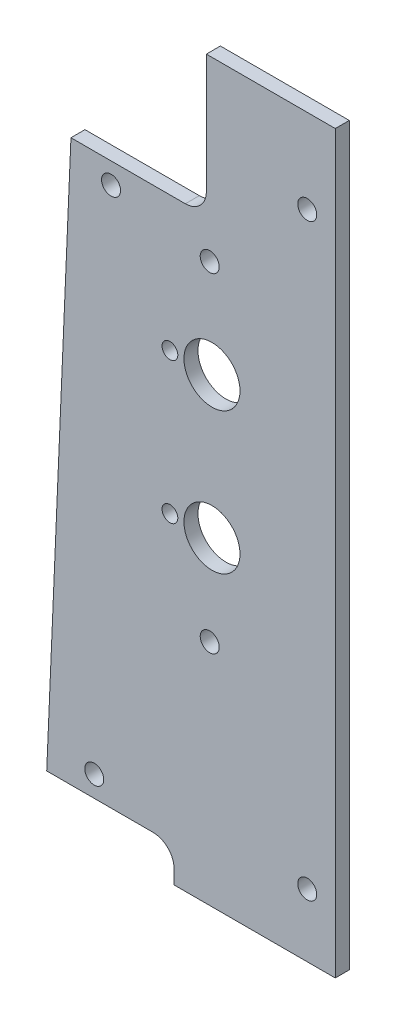
ISO-10303-21;
HEADER;
FILE_DESCRIPTION(('STEP AP214'),'2;1');
FILE_NAME('part.step','',(''),(''),'','','');
FILE_SCHEMA(('AUTOMOTIVE_DESIGN { 1 0 10303 214 1 1 1 1 }'));
ENDSEC;
DATA;
#1=APPLICATION_CONTEXT('core data for automotive mechanical design processes');
#2=APPLICATION_PROTOCOL_DEFINITION('international standard','automotive_design',2000,#1);
#3=PRODUCT_CONTEXT('',#1,'mechanical');
#4=PRODUCT('Part','Part','',(#3));
#5=PRODUCT_RELATED_PRODUCT_CATEGORY('part','',(#4));
#6=PRODUCT_DEFINITION_FORMATION('','',#4);
#7=PRODUCT_DEFINITION_CONTEXT('part definition',#1,'design');
#8=PRODUCT_DEFINITION('design','',#6,#7);
#9=PRODUCT_DEFINITION_SHAPE('','',#8);
#10=(LENGTH_UNIT() NAMED_UNIT(*) SI_UNIT(.MILLI.,.METRE.));
#11=(NAMED_UNIT(*) PLANE_ANGLE_UNIT() SI_UNIT($,.RADIAN.));
#12=(NAMED_UNIT(*) SI_UNIT($,.STERADIAN.) SOLID_ANGLE_UNIT());
#13=UNCERTAINTY_MEASURE_WITH_UNIT(LENGTH_MEASURE(1.E-05),#10,'distance_accuracy_value','');
#14=(GEOMETRIC_REPRESENTATION_CONTEXT(3) GLOBAL_UNCERTAINTY_ASSIGNED_CONTEXT((#13)) GLOBAL_UNIT_ASSIGNED_CONTEXT((#10,
#11,#12)) REPRESENTATION_CONTEXT('',''));
#15=CARTESIAN_POINT('',(0.,0.,0.));
#16=DIRECTION('',(0.,0.,1.));
#17=DIRECTION('',(1.,0.,0.));
#18=AXIS2_PLACEMENT_3D('',#15,#16,#17);
#19=CARTESIAN_POINT('',(-36.5125,3.175,-3.175));
#20=DIRECTION('',(-1.,0.,0.));
#21=DIRECTION('',(0.,-1.,0.));
#22=AXIS2_PLACEMENT_3D('',#19,#20,#21);
#23=PLANE('',#22);
#24=DIRECTION('',(0.,-1.,0.));
#25=VECTOR('',#24,1.);
#26=CARTESIAN_POINT('',(-36.5125,3.175,0.));
#27=LINE('',#26,#25);
#28=CARTESIAN_POINT('',(-36.5125,3.175,0.));
#29=VERTEX_POINT('',#28);
#30=CARTESIAN_POINT('',(-36.5125,0.,0.));
#31=VERTEX_POINT('',#30);
#32=EDGE_CURVE('E145',#29,#31,#27,.T.);
#33=ORIENTED_EDGE('',*,*,#32,.F.);
#34=DIRECTION('',(0.,0.,1.));
#35=VECTOR('',#34,1.);
#36=CARTESIAN_POINT('',(-36.5125,3.175,-3.175));
#37=LINE('',#36,#35);
#38=CARTESIAN_POINT('',(-36.5125,3.175,-3.175));
#39=VERTEX_POINT('',#38);
#40=EDGE_CURVE('E11',#39,#29,#37,.T.);
#41=ORIENTED_EDGE('',*,*,#40,.F.);
#42=DIRECTION('',(0.,-1.,0.));
#43=VECTOR('',#42,1.);
#44=CARTESIAN_POINT('',(-36.5125,3.175,-3.175));
#45=LINE('',#44,#43);
#46=CARTESIAN_POINT('',(-36.5125,0.,-3.175));
#47=VERTEX_POINT('',#46);
#48=EDGE_CURVE('E172',#39,#47,#45,.T.);
#49=ORIENTED_EDGE('',*,*,#48,.T.);
#50=DIRECTION('',(0.,0.,1.));
#51=VECTOR('',#50,1.);
#52=CARTESIAN_POINT('',(-36.5125,0.,-3.175));
#53=LINE('',#52,#51);
#54=EDGE_CURVE('E39',#47,#31,#53,.T.);
#55=ORIENTED_EDGE('',*,*,#54,.T.);
#56=EDGE_LOOP('',(#33,#41,#49,#55));
#57=FACE_BOUND('',#56,.T.);
#58=ADVANCED_FACE('F36',(#57),#23,.T.);
#59=CARTESIAN_POINT('',(-41.275,3.175,-3.175));
#60=DIRECTION('',(0.,0.,1.));
#61=DIRECTION('',(1.,0.,0.));
#62=AXIS2_PLACEMENT_3D('',#59,#60,#61);
#63=CYLINDRICAL_SURFACE('',#62,4.7625);
#64=CARTESIAN_POINT('',(-41.275,3.175,0.));
#65=DIRECTION('',(0.,0.,-1.));
#66=DIRECTION('',(1.,0.,0.));
#67=AXIS2_PLACEMENT_3D('',#64,#65,#66);
#68=CIRCLE('',#67,4.7625);
#69=CARTESIAN_POINT('',(-41.275,7.9375,0.));
#70=VERTEX_POINT('',#69);
#71=EDGE_CURVE('E170',#70,#29,#68,.T.);
#72=ORIENTED_EDGE('',*,*,#71,.F.);
#73=DIRECTION('',(0.,0.,1.));
#74=VECTOR('',#73,1.);
#75=CARTESIAN_POINT('',(-41.275,7.9375,-3.175));
#76=LINE('',#75,#74);
#77=CARTESIAN_POINT('',(-41.275,7.9375,-3.175));
#78=VERTEX_POINT('',#77);
#79=EDGE_CURVE('E45',#78,#70,#76,.T.);
#80=ORIENTED_EDGE('',*,*,#79,.F.);
#81=CARTESIAN_POINT('',(-41.275,3.175,-3.175));
#82=DIRECTION('',(0.,0.,-1.));
#83=DIRECTION('',(1.,0.,0.));
#84=AXIS2_PLACEMENT_3D('',#81,#82,#83);
#85=CIRCLE('',#84,4.7625);
#86=EDGE_CURVE('E135',#78,#39,#85,.T.);
#87=ORIENTED_EDGE('',*,*,#86,.T.);
#88=ORIENTED_EDGE('',*,*,#40,.T.);
#89=EDGE_LOOP('',(#72,#80,#87,#88));
#90=FACE_BOUND('',#89,.T.);
#91=ADVANCED_FACE('F188',(#90),#63,.F.);
#92=CARTESIAN_POINT('',(-65.3794505882353,7.9375,-3.175));
#93=DIRECTION('',(0.,-1.,0.));
#94=DIRECTION('',(0.,0.,-1.));
#95=AXIS2_PLACEMENT_3D('',#92,#93,#94);
#96=PLANE('',#95);
#97=DIRECTION('',(1.,0.,0.));
#98=VECTOR('',#97,1.);
#99=CARTESIAN_POINT('',(-65.3794505882353,7.9375,0.));
#100=LINE('',#99,#98);
#101=CARTESIAN_POINT('',(-65.3794505882353,7.9375,0.));
#102=VERTEX_POINT('',#101);
#103=EDGE_CURVE('E122',#102,#70,#100,.T.);
#104=ORIENTED_EDGE('',*,*,#103,.F.);
#105=DIRECTION('',(0.,0.,1.));
#106=VECTOR('',#105,1.);
#107=CARTESIAN_POINT('',(-65.3794505882353,7.9375,-3.175));
#108=LINE('',#107,#106);
#109=CARTESIAN_POINT('',(-65.3794505882353,7.9375,-3.175));
#110=VERTEX_POINT('',#109);
#111=EDGE_CURVE('E117',#110,#102,#108,.T.);
#112=ORIENTED_EDGE('',*,*,#111,.F.);
#113=DIRECTION('',(1.,0.,0.));
#114=VECTOR('',#113,1.);
#115=CARTESIAN_POINT('',(-65.3794505882353,7.9375,-3.175));
#116=LINE('',#115,#114);
#117=EDGE_CURVE('E120',#110,#78,#116,.T.);
#118=ORIENTED_EDGE('',*,*,#117,.T.);
#119=ORIENTED_EDGE('',*,*,#79,.T.);
#120=EDGE_LOOP('',(#104,#112,#118,#119));
#121=FACE_BOUND('',#120,.T.);
#122=ADVANCED_FACE('F119',(#121),#96,.T.);
#123=CARTESIAN_POINT('',(-59.89066,134.9375,-3.175));
#124=DIRECTION('',(-0.999067372960438,0.0431785164859704,0.));
#125=DIRECTION('',(-0.0431785164859704,-0.999067372960438,0.));
#126=AXIS2_PLACEMENT_3D('',#123,#124,#125);
#127=PLANE('',#126);
#128=DIRECTION('',(-0.0431785164859704,-0.999067372960438,0.));
#129=VECTOR('',#128,1.);
#130=CARTESIAN_POINT('',(-59.89066,134.9375,0.));
#131=LINE('',#130,#129);
#132=CARTESIAN_POINT('',(-59.89066,134.9375,0.));
#133=VERTEX_POINT('',#132);
#134=EDGE_CURVE('E167',#133,#102,#131,.T.);
#135=ORIENTED_EDGE('',*,*,#134,.F.);
#136=DIRECTION('',(0.,0.,1.));
#137=VECTOR('',#136,1.);
#138=CARTESIAN_POINT('',(-59.89066,134.9375,-3.175));
#139=LINE('',#138,#137);
#140=CARTESIAN_POINT('',(-59.89066,134.9375,-3.175));
#141=VERTEX_POINT('',#140);
#142=EDGE_CURVE('E127',#141,#133,#139,.T.);
#143=ORIENTED_EDGE('',*,*,#142,.F.);
#144=DIRECTION('',(-0.0431785164859704,-0.999067372960438,0.));
#145=VECTOR('',#144,1.);
#146=CARTESIAN_POINT('',(-59.89066,134.9375,-3.175));
#147=LINE('',#146,#145);
#148=EDGE_CURVE('E133',#141,#110,#147,.T.);
#149=ORIENTED_EDGE('',*,*,#148,.T.);
#150=ORIENTED_EDGE('',*,*,#111,.T.);
#151=EDGE_LOOP('',(#135,#143,#149,#150));
#152=FACE_BOUND('',#151,.T.);
#153=ADVANCED_FACE('F137',(#152),#127,.T.);
#154=CARTESIAN_POINT('',(-33.9725,134.9375,-3.175));
#155=DIRECTION('',(0.,1.,0.));
#156=DIRECTION('',(-1.,0.,0.));
#157=AXIS2_PLACEMENT_3D('',#154,#155,#156);
#158=PLANE('',#157);
#159=DIRECTION('',(-1.,0.,0.));
#160=VECTOR('',#159,1.);
#161=CARTESIAN_POINT('',(-33.9725,134.9375,0.));
#162=LINE('',#161,#160);
#163=CARTESIAN_POINT('',(-33.9725,134.9375,0.));
#164=VERTEX_POINT('',#163);
#165=EDGE_CURVE('E164',#164,#133,#162,.T.);
#166=ORIENTED_EDGE('',*,*,#165,.F.);
#167=DIRECTION('',(0.,0.,1.));
#168=VECTOR('',#167,1.);
#169=CARTESIAN_POINT('',(-33.9725,134.9375,-3.175));
#170=LINE('',#169,#168);
#171=CARTESIAN_POINT('',(-33.9725,134.9375,-3.175));
#172=VERTEX_POINT('',#171);
#173=EDGE_CURVE('E176',#172,#164,#170,.T.);
#174=ORIENTED_EDGE('',*,*,#173,.F.);
#175=DIRECTION('',(-1.,0.,0.));
#176=VECTOR('',#175,1.);
#177=CARTESIAN_POINT('',(-33.9725,134.9375,-3.175));
#178=LINE('',#177,#176);
#179=EDGE_CURVE('E138',#172,#141,#178,.T.);
#180=ORIENTED_EDGE('',*,*,#179,.T.);
#181=ORIENTED_EDGE('',*,*,#142,.T.);
#182=EDGE_LOOP('',(#166,#174,#180,#181));
#183=FACE_BOUND('',#182,.T.);
#184=ADVANCED_FACE('F201',(#183),#158,.T.);
#185=CARTESIAN_POINT('',(-33.9725,139.7,-3.175));
#186=DIRECTION('',(0.,0.,1.));
#187=DIRECTION('',(1.,0.,0.));
#188=AXIS2_PLACEMENT_3D('',#185,#186,#187);
#189=CYLINDRICAL_SURFACE('',#188,4.7625);
#190=CARTESIAN_POINT('',(-33.9725,139.7,0.));
#191=DIRECTION('',(0.,0.,-1.));
#192=DIRECTION('',(1.,0.,0.));
#193=AXIS2_PLACEMENT_3D('',#190,#191,#192);
#194=CIRCLE('',#193,4.7625);
#195=CARTESIAN_POINT('',(-29.21,139.7,0.));
#196=VERTEX_POINT('',#195);
#197=EDGE_CURVE('E161',#196,#164,#194,.T.);
#198=ORIENTED_EDGE('',*,*,#197,.F.);
#199=DIRECTION('',(0.,0.,1.));
#200=VECTOR('',#199,1.);
#201=CARTESIAN_POINT('',(-29.21,139.7,-3.175));
#202=LINE('',#201,#200);
#203=CARTESIAN_POINT('',(-29.21,139.7,-3.175));
#204=VERTEX_POINT('',#203);
#205=EDGE_CURVE('E178',#204,#196,#202,.T.);
#206=ORIENTED_EDGE('',*,*,#205,.F.);
#207=CARTESIAN_POINT('',(-33.9725,139.7,-3.175));
#208=DIRECTION('',(0.,0.,-1.));
#209=DIRECTION('',(1.,0.,0.));
#210=AXIS2_PLACEMENT_3D('',#207,#208,#209);
#211=CIRCLE('',#210,4.7625);
#212=EDGE_CURVE('E140',#204,#172,#211,.T.);
#213=ORIENTED_EDGE('',*,*,#212,.T.);
#214=ORIENTED_EDGE('',*,*,#173,.T.);
#215=EDGE_LOOP('',(#198,#206,#213,#214));
#216=FACE_BOUND('',#215,.T.);
#217=ADVANCED_FACE('F204',(#216),#189,.F.);
#218=CARTESIAN_POINT('',(-29.21,166.6875,-3.175));
#219=DIRECTION('',(-1.,0.,0.));
#220=DIRECTION('',(0.,0.,1.));
#221=AXIS2_PLACEMENT_3D('',#218,#219,#220);
#222=PLANE('',#221);
#223=DIRECTION('',(0.,-1.,0.));
#224=VECTOR('',#223,1.);
#225=CARTESIAN_POINT('',(-29.21,166.6875,0.));
#226=LINE('',#225,#224);
#227=CARTESIAN_POINT('',(-29.21,166.6875,0.));
#228=VERTEX_POINT('',#227);
#229=EDGE_CURVE('E158',#228,#196,#226,.T.);
#230=ORIENTED_EDGE('',*,*,#229,.F.);
#231=DIRECTION('',(0.,0.,1.));
#232=VECTOR('',#231,1.);
#233=CARTESIAN_POINT('',(-29.21,166.6875,-3.175));
#234=LINE('',#233,#232);
#235=CARTESIAN_POINT('',(-29.21,166.6875,-3.175));
#236=VERTEX_POINT('',#235);
#237=EDGE_CURVE('E180',#236,#228,#234,.T.);
#238=ORIENTED_EDGE('',*,*,#237,.F.);
#239=DIRECTION('',(0.,-1.,0.));
#240=VECTOR('',#239,1.);
#241=CARTESIAN_POINT('',(-29.21,166.6875,-3.175));
#242=LINE('',#241,#240);
#243=EDGE_CURVE('E344',#236,#204,#242,.T.);
#244=ORIENTED_EDGE('',*,*,#243,.T.);
#245=ORIENTED_EDGE('',*,*,#205,.T.);
#246=EDGE_LOOP('',(#230,#238,#244,#245));
#247=FACE_BOUND('',#246,.T.);
#248=ADVANCED_FACE('F208',(#247),#222,.T.);
#249=CARTESIAN_POINT('',(0.,166.6875,-3.175));
#250=DIRECTION('',(0.,1.,0.));
#251=DIRECTION('',(0.,0.,1.));
#252=AXIS2_PLACEMENT_3D('',#249,#250,#251);
#253=PLANE('',#252);
#254=DIRECTION('',(-1.,0.,0.));
#255=VECTOR('',#254,1.);
#256=CARTESIAN_POINT('',(0.,166.6875,0.));
#257=LINE('',#256,#255);
#258=CARTESIAN_POINT('',(0.,166.6875,0.));
#259=VERTEX_POINT('',#258);
#260=EDGE_CURVE('E155',#259,#228,#257,.T.);
#261=ORIENTED_EDGE('',*,*,#260,.F.);
#262=DIRECTION('',(0.,0.,1.));
#263=VECTOR('',#262,1.);
#264=CARTESIAN_POINT('',(0.,166.6875,-3.175));
#265=LINE('',#264,#263);
#266=CARTESIAN_POINT('',(0.,166.6875,-3.175));
#267=VERTEX_POINT('',#266);
#268=EDGE_CURVE('E182',#267,#259,#265,.T.);
#269=ORIENTED_EDGE('',*,*,#268,.F.);
#270=DIRECTION('',(-1.,0.,0.));
#271=VECTOR('',#270,1.);
#272=CARTESIAN_POINT('',(0.,166.6875,-3.175));
#273=LINE('',#272,#271);
#274=EDGE_CURVE('E341',#267,#236,#273,.T.);
#275=ORIENTED_EDGE('',*,*,#274,.T.);
#276=ORIENTED_EDGE('',*,*,#237,.T.);
#277=EDGE_LOOP('',(#261,#269,#275,#276));
#278=FACE_BOUND('',#277,.T.);
#279=ADVANCED_FACE('F212',(#278),#253,.T.);
#280=CARTESIAN_POINT('',(0.,0.,-3.175));
#281=DIRECTION('',(1.,0.,0.));
#282=DIRECTION('',(0.,1.,0.));
#283=AXIS2_PLACEMENT_3D('',#280,#281,#282);
#284=PLANE('',#283);
#285=DIRECTION('',(0.,1.,0.));
#286=VECTOR('',#285,1.);
#287=CARTESIAN_POINT('',(0.,0.,0.));
#288=LINE('',#287,#286);
#289=CARTESIAN_POINT('',(0.,0.,0.));
#290=VERTEX_POINT('',#289);
#291=EDGE_CURVE('E152',#290,#259,#288,.T.);
#292=ORIENTED_EDGE('',*,*,#291,.F.);
#293=DIRECTION('',(0.,0.,1.));
#294=VECTOR('',#293,1.);
#295=CARTESIAN_POINT('',(0.,0.,-3.175));
#296=LINE('',#295,#294);
#297=CARTESIAN_POINT('',(0.,0.,-3.175));
#298=VERTEX_POINT('',#297);
#299=EDGE_CURVE('E183',#298,#290,#296,.T.);
#300=ORIENTED_EDGE('',*,*,#299,.F.);
#301=DIRECTION('',(0.,1.,0.));
#302=VECTOR('',#301,1.);
#303=CARTESIAN_POINT('',(0.,0.,-3.175));
#304=LINE('',#303,#302);
#305=EDGE_CURVE('E338',#298,#267,#304,.T.);
#306=ORIENTED_EDGE('',*,*,#305,.T.);
#307=ORIENTED_EDGE('',*,*,#268,.T.);
#308=EDGE_LOOP('',(#292,#300,#306,#307));
#309=FACE_BOUND('',#308,.T.);
#310=ADVANCED_FACE('F216',(#309),#284,.T.);
#311=CARTESIAN_POINT('',(-36.5125,0.,-3.175));
#312=DIRECTION('',(0.,-1.,0.));
#313=DIRECTION('',(1.,0.,0.));
#314=AXIS2_PLACEMENT_3D('',#311,#312,#313);
#315=PLANE('',#314);
#316=DIRECTION('',(1.,0.,0.));
#317=VECTOR('',#316,1.);
#318=CARTESIAN_POINT('',(-36.5125,0.,0.));
#319=LINE('',#318,#317);
#320=EDGE_CURVE('E148',#31,#290,#319,.T.);
#321=ORIENTED_EDGE('',*,*,#320,.F.);
#322=ORIENTED_EDGE('',*,*,#54,.F.);
#323=DIRECTION('',(1.,0.,0.));
#324=VECTOR('',#323,1.);
#325=CARTESIAN_POINT('',(-36.5125,0.,-3.175));
#326=LINE('',#325,#324);
#327=EDGE_CURVE('E336',#47,#298,#326,.T.);
#328=ORIENTED_EDGE('',*,*,#327,.T.);
#329=ORIENTED_EDGE('',*,*,#299,.T.);
#330=EDGE_LOOP('',(#321,#322,#328,#329));
#331=FACE_BOUND('',#330,.T.);
#332=ADVANCED_FACE('F185',(#331),#315,.T.);
#333=CARTESIAN_POINT('',(-33.9725,139.7,-3.175));
#334=DIRECTION('',(0.,0.,1.));
#335=DIRECTION('',(1.,0.,0.));
#336=AXIS2_PLACEMENT_3D('',#333,#334,#335);
#337=PLANE('',#336);
#338=CARTESIAN_POINT('',(-50.8,130.175,-3.175));
#339=DIRECTION('',(0.,0.,1.));
#340=DIRECTION('',(1.,0.,0.));
#341=AXIS2_PLACEMENT_3D('',#338,#339,#340);
#342=CIRCLE('',#341,2.15265);
#343=CARTESIAN_POINT('',(-48.64735,130.175,-3.175));
#344=VERTEX_POINT('',#343);
#345=EDGE_CURVE('E275',#344,#344,#342,.T.);
#346=ORIENTED_EDGE('',*,*,#345,.T.);
#347=EDGE_LOOP('',(#346));
#348=FACE_BOUND('',#347,.T.);
#349=CARTESIAN_POINT('',(-6.34999999999998,147.6375,-3.175));
#350=DIRECTION('',(0.,0.,1.));
#351=DIRECTION('',(1.,0.,0.));
#352=AXIS2_PLACEMENT_3D('',#349,#350,#351);
#353=CIRCLE('',#352,2.15265);
#354=CARTESIAN_POINT('',(-4.19734999999998,147.6375,-3.175));
#355=VERTEX_POINT('',#354);
#356=EDGE_CURVE('E285',#355,#355,#353,.T.);
#357=ORIENTED_EDGE('',*,*,#356,.T.);
#358=EDGE_LOOP('',(#357));
#359=FACE_BOUND('',#358,.T.);
#360=CARTESIAN_POINT('',(-6.35,14.2875,-3.175));
#361=DIRECTION('',(0.,0.,1.));
#362=DIRECTION('',(1.,0.,0.));
#363=AXIS2_PLACEMENT_3D('',#360,#361,#362);
#364=CIRCLE('',#363,2.15265);
#365=CARTESIAN_POINT('',(-4.19735,14.2875,-3.175));
#366=VERTEX_POINT('',#365);
#367=EDGE_CURVE('E291',#366,#366,#364,.T.);
#368=ORIENTED_EDGE('',*,*,#367,.T.);
#369=EDGE_LOOP('',(#368));
#370=FACE_BOUND('',#369,.T.);
#371=CARTESIAN_POINT('',(-54.61,12.7,-3.175));
#372=DIRECTION('',(0.,0.,1.));
#373=DIRECTION('',(1.,0.,0.));
#374=AXIS2_PLACEMENT_3D('',#371,#372,#373);
#375=CIRCLE('',#374,2.15265);
#376=CARTESIAN_POINT('',(-52.45735,12.7,-3.175));
#377=VERTEX_POINT('',#376);
#378=EDGE_CURVE('E297',#377,#377,#375,.T.);
#379=ORIENTED_EDGE('',*,*,#378,.T.);
#380=EDGE_LOOP('',(#379));
#381=FACE_BOUND('',#380,.T.);
#382=CARTESIAN_POINT('',(-28.448,51.7525,-3.175));
#383=DIRECTION('',(0.,0.,1.));
#384=DIRECTION('',(1.,0.,0.));
#385=AXIS2_PLACEMENT_3D('',#382,#383,#384);
#386=CIRCLE('',#385,2.15265);
#387=CARTESIAN_POINT('',(-26.29535,51.7525,-3.175));
#388=VERTEX_POINT('',#387);
#389=EDGE_CURVE('E303',#388,#388,#386,.T.);
#390=ORIENTED_EDGE('',*,*,#389,.T.);
#391=EDGE_LOOP('',(#390));
#392=FACE_BOUND('',#391,.T.);
#393=CARTESIAN_POINT('',(-28.448,126.365,-3.175));
#394=DIRECTION('',(0.,0.,1.));
#395=DIRECTION('',(1.,0.,0.));
#396=AXIS2_PLACEMENT_3D('',#393,#394,#395);
#397=CIRCLE('',#396,2.15265);
#398=CARTESIAN_POINT('',(-26.29535,126.365,-3.175));
#399=VERTEX_POINT('',#398);
#400=EDGE_CURVE('E309',#399,#399,#397,.T.);
#401=ORIENTED_EDGE('',*,*,#400,.T.);
#402=EDGE_LOOP('',(#401));
#403=FACE_BOUND('',#402,.T.);
#404=CARTESIAN_POINT('',(-27.94,72.39,-3.175));
#405=DIRECTION('',(0.,0.,1.));
#406=DIRECTION('',(1.,0.,0.));
#407=AXIS2_PLACEMENT_3D('',#404,#405,#406);
#408=CIRCLE('',#407,6.34999999999999);
#409=CARTESIAN_POINT('',(-21.59,72.39,-3.175));
#410=VERTEX_POINT('',#409);
#411=EDGE_CURVE('E315',#410,#410,#408,.T.);
#412=ORIENTED_EDGE('',*,*,#411,.T.);
#413=EDGE_LOOP('',(#412));
#414=FACE_BOUND('',#413,.T.);
#415=CARTESIAN_POINT('',(-27.94,104.394,-3.175));
#416=DIRECTION('',(0.,0.,1.));
#417=DIRECTION('',(1.,0.,0.));
#418=AXIS2_PLACEMENT_3D('',#415,#416,#417);
#419=CIRCLE('',#418,6.34999999999999);
#420=CARTESIAN_POINT('',(-21.59,104.394,-3.175));
#421=VERTEX_POINT('',#420);
#422=EDGE_CURVE('E321',#421,#421,#419,.T.);
#423=ORIENTED_EDGE('',*,*,#422,.T.);
#424=EDGE_LOOP('',(#423));
#425=FACE_BOUND('',#424,.T.);
#426=CARTESIAN_POINT('',(-37.465,72.39,-3.175));
#427=DIRECTION('',(0.,0.,1.));
#428=DIRECTION('',(1.,0.,0.));
#429=AXIS2_PLACEMENT_3D('',#426,#427,#428);
#430=CIRCLE('',#429,1.786001);
#431=CARTESIAN_POINT('',(-35.678999,72.39,-3.175));
#432=VERTEX_POINT('',#431);
#433=EDGE_CURVE('E327',#432,#432,#430,.T.);
#434=ORIENTED_EDGE('',*,*,#433,.T.);
#435=EDGE_LOOP('',(#434));
#436=FACE_BOUND('',#435,.T.);
#437=CARTESIAN_POINT('',(-37.465,104.394,-3.175));
#438=DIRECTION('',(0.,0.,1.));
#439=DIRECTION('',(1.,0.,0.));
#440=AXIS2_PLACEMENT_3D('',#437,#438,#439);
#441=CIRCLE('',#440,1.786001);
#442=CARTESIAN_POINT('',(-35.678999,104.394,-3.175));
#443=VERTEX_POINT('',#442);
#444=EDGE_CURVE('E149',#443,#443,#441,.T.);
#445=ORIENTED_EDGE('',*,*,#444,.T.);
#446=EDGE_LOOP('',(#445));
#447=FACE_BOUND('',#446,.T.);
#448=ORIENTED_EDGE('',*,*,#48,.F.);
#449=ORIENTED_EDGE('',*,*,#86,.F.);
#450=ORIENTED_EDGE('',*,*,#117,.F.);
#451=ORIENTED_EDGE('',*,*,#148,.F.);
#452=ORIENTED_EDGE('',*,*,#179,.F.);
#453=ORIENTED_EDGE('',*,*,#212,.F.);
#454=ORIENTED_EDGE('',*,*,#243,.F.);
#455=ORIENTED_EDGE('',*,*,#274,.F.);
#456=ORIENTED_EDGE('',*,*,#305,.F.);
#457=ORIENTED_EDGE('',*,*,#327,.F.);
#458=EDGE_LOOP('',(#448,#449,#450,#451,#452,#453,#454,#455,#456,#457));
#459=FACE_BOUND('',#458,.T.);
#460=ADVANCED_FACE('F131',(#348,#359,#370,#381,#392,#403,#414,#425,#436,#447,#459),#337,.F.);
#461=CARTESIAN_POINT('',(-33.9725,139.7,0.));
#462=DIRECTION('',(0.,0.,1.));
#463=DIRECTION('',(1.,0.,0.));
#464=AXIS2_PLACEMENT_3D('',#461,#462,#463);
#465=PLANE('',#464);
#466=CARTESIAN_POINT('',(-50.8,130.175,0.));
#467=DIRECTION('',(0.,0.,1.));
#468=DIRECTION('',(1.,0.,0.));
#469=AXIS2_PLACEMENT_3D('',#466,#467,#468);
#470=CIRCLE('',#469,2.15264999999999);
#471=CARTESIAN_POINT('',(-48.64735,130.175,0.));
#472=VERTEX_POINT('',#471);
#473=EDGE_CURVE('E278',#472,#472,#470,.T.);
#474=ORIENTED_EDGE('',*,*,#473,.F.);
#475=EDGE_LOOP('',(#474));
#476=FACE_BOUND('',#475,.T.);
#477=CARTESIAN_POINT('',(-6.34999999999998,147.6375,0.));
#478=DIRECTION('',(0.,0.,1.));
#479=DIRECTION('',(1.,0.,0.));
#480=AXIS2_PLACEMENT_3D('',#477,#478,#479);
#481=CIRCLE('',#480,2.15264999999999);
#482=CARTESIAN_POINT('',(-4.19734999999999,147.6375,0.));
#483=VERTEX_POINT('',#482);
#484=EDGE_CURVE('E280',#483,#483,#481,.T.);
#485=ORIENTED_EDGE('',*,*,#484,.F.);
#486=EDGE_LOOP('',(#485));
#487=FACE_BOUND('',#486,.T.);
#488=CARTESIAN_POINT('',(-6.35,14.2875,0.));
#489=DIRECTION('',(0.,0.,1.));
#490=DIRECTION('',(1.,0.,0.));
#491=AXIS2_PLACEMENT_3D('',#488,#489,#490);
#492=CIRCLE('',#491,2.15264999999999);
#493=CARTESIAN_POINT('',(-4.19735000000001,14.2875,0.));
#494=VERTEX_POINT('',#493);
#495=EDGE_CURVE('E288',#494,#494,#492,.T.);
#496=ORIENTED_EDGE('',*,*,#495,.F.);
#497=EDGE_LOOP('',(#496));
#498=FACE_BOUND('',#497,.T.);
#499=CARTESIAN_POINT('',(-54.61,12.7,0.));
#500=DIRECTION('',(0.,0.,1.));
#501=DIRECTION('',(1.,0.,0.));
#502=AXIS2_PLACEMENT_3D('',#499,#500,#501);
#503=CIRCLE('',#502,2.15264999999999);
#504=CARTESIAN_POINT('',(-52.45735,12.7,0.));
#505=VERTEX_POINT('',#504);
#506=EDGE_CURVE('E294',#505,#505,#503,.T.);
#507=ORIENTED_EDGE('',*,*,#506,.F.);
#508=EDGE_LOOP('',(#507));
#509=FACE_BOUND('',#508,.T.);
#510=CARTESIAN_POINT('',(-28.448,51.7525,0.));
#511=DIRECTION('',(0.,0.,1.));
#512=DIRECTION('',(1.,0.,0.));
#513=AXIS2_PLACEMENT_3D('',#510,#511,#512);
#514=CIRCLE('',#513,2.15265);
#515=CARTESIAN_POINT('',(-26.29535,51.7525,0.));
#516=VERTEX_POINT('',#515);
#517=EDGE_CURVE('E300',#516,#516,#514,.T.);
#518=ORIENTED_EDGE('',*,*,#517,.F.);
#519=EDGE_LOOP('',(#518));
#520=FACE_BOUND('',#519,.T.);
#521=CARTESIAN_POINT('',(-28.448,126.365,0.));
#522=DIRECTION('',(0.,0.,1.));
#523=DIRECTION('',(1.,0.,0.));
#524=AXIS2_PLACEMENT_3D('',#521,#522,#523);
#525=CIRCLE('',#524,2.15265);
#526=CARTESIAN_POINT('',(-26.29535,126.365,0.));
#527=VERTEX_POINT('',#526);
#528=EDGE_CURVE('E306',#527,#527,#525,.T.);
#529=ORIENTED_EDGE('',*,*,#528,.F.);
#530=EDGE_LOOP('',(#529));
#531=FACE_BOUND('',#530,.T.);
#532=CARTESIAN_POINT('',(-27.94,72.39,0.));
#533=DIRECTION('',(0.,0.,1.));
#534=DIRECTION('',(1.,0.,0.));
#535=AXIS2_PLACEMENT_3D('',#532,#533,#534);
#536=CIRCLE('',#535,6.34999999999999);
#537=CARTESIAN_POINT('',(-21.59,72.39,0.));
#538=VERTEX_POINT('',#537);
#539=EDGE_CURVE('E312',#538,#538,#536,.T.);
#540=ORIENTED_EDGE('',*,*,#539,.F.);
#541=EDGE_LOOP('',(#540));
#542=FACE_BOUND('',#541,.T.);
#543=CARTESIAN_POINT('',(-27.94,104.394,0.));
#544=DIRECTION('',(0.,0.,1.));
#545=DIRECTION('',(1.,0.,0.));
#546=AXIS2_PLACEMENT_3D('',#543,#544,#545);
#547=CIRCLE('',#546,6.34999999999999);
#548=CARTESIAN_POINT('',(-21.59,104.394,0.));
#549=VERTEX_POINT('',#548);
#550=EDGE_CURVE('E318',#549,#549,#547,.T.);
#551=ORIENTED_EDGE('',*,*,#550,.F.);
#552=EDGE_LOOP('',(#551));
#553=FACE_BOUND('',#552,.T.);
#554=CARTESIAN_POINT('',(-37.465,72.39,0.));
#555=DIRECTION('',(0.,0.,1.));
#556=DIRECTION('',(1.,0.,0.));
#557=AXIS2_PLACEMENT_3D('',#554,#555,#556);
#558=CIRCLE('',#557,1.78600099999999);
#559=CARTESIAN_POINT('',(-35.678999,72.39,0.));
#560=VERTEX_POINT('',#559);
#561=EDGE_CURVE('E324',#560,#560,#558,.T.);
#562=ORIENTED_EDGE('',*,*,#561,.F.);
#563=EDGE_LOOP('',(#562));
#564=FACE_BOUND('',#563,.T.);
#565=CARTESIAN_POINT('',(-37.465,104.394,0.));
#566=DIRECTION('',(0.,0.,1.));
#567=DIRECTION('',(1.,0.,0.));
#568=AXIS2_PLACEMENT_3D('',#565,#566,#567);
#569=CIRCLE('',#568,1.78600099999999);
#570=CARTESIAN_POINT('',(-35.678999,104.394,0.));
#571=VERTEX_POINT('',#570);
#572=EDGE_CURVE('E330',#571,#571,#569,.T.);
#573=ORIENTED_EDGE('',*,*,#572,.F.);
#574=EDGE_LOOP('',(#573));
#575=FACE_BOUND('',#574,.T.);
#576=ORIENTED_EDGE('',*,*,#32,.T.);
#577=ORIENTED_EDGE('',*,*,#320,.T.);
#578=ORIENTED_EDGE('',*,*,#291,.T.);
#579=ORIENTED_EDGE('',*,*,#260,.T.);
#580=ORIENTED_EDGE('',*,*,#229,.T.);
#581=ORIENTED_EDGE('',*,*,#197,.T.);
#582=ORIENTED_EDGE('',*,*,#165,.T.);
#583=ORIENTED_EDGE('',*,*,#134,.T.);
#584=ORIENTED_EDGE('',*,*,#103,.T.);
#585=ORIENTED_EDGE('',*,*,#71,.T.);
#586=EDGE_LOOP('',(#576,#577,#578,#579,#580,#581,#582,#583,#584,#585));
#587=FACE_BOUND('',#586,.T.);
#588=ADVANCED_FACE('F187',(#476,#487,#498,#509,#520,#531,#542,#553,#564,#575,#587),#465,.T.);
#589=CARTESIAN_POINT('',(-37.465,104.394,0.));
#590=DIRECTION('',(0.,0.,1.));
#591=DIRECTION('',(1.,0.,0.));
#592=AXIS2_PLACEMENT_3D('',#589,#590,#591);
#593=CYLINDRICAL_SURFACE('',#592,1.78600099999999);
#594=ORIENTED_EDGE('',*,*,#444,.F.);
#595=EDGE_LOOP('',(#594));
#596=FACE_BOUND('',#595,.T.);
#597=ORIENTED_EDGE('',*,*,#572,.T.);
#598=EDGE_LOOP('',(#597));
#599=FACE_BOUND('',#598,.T.);
#600=ADVANCED_FACE('F228',(#596,#599),#593,.F.);
#601=CARTESIAN_POINT('',(-37.465,72.39,0.));
#602=DIRECTION('',(0.,0.,1.));
#603=DIRECTION('',(1.,0.,0.));
#604=AXIS2_PLACEMENT_3D('',#601,#602,#603);
#605=CYLINDRICAL_SURFACE('',#604,1.78600099999999);
#606=ORIENTED_EDGE('',*,*,#433,.F.);
#607=EDGE_LOOP('',(#606));
#608=FACE_BOUND('',#607,.T.);
#609=ORIENTED_EDGE('',*,*,#561,.T.);
#610=EDGE_LOOP('',(#609));
#611=FACE_BOUND('',#610,.T.);
#612=ADVANCED_FACE('F235',(#608,#611),#605,.F.);
#613=CARTESIAN_POINT('',(-27.94,104.394,0.));
#614=DIRECTION('',(0.,0.,1.));
#615=DIRECTION('',(1.,0.,0.));
#616=AXIS2_PLACEMENT_3D('',#613,#614,#615);
#617=CYLINDRICAL_SURFACE('',#616,6.34999999999999);
#618=ORIENTED_EDGE('',*,*,#422,.F.);
#619=EDGE_LOOP('',(#618));
#620=FACE_BOUND('',#619,.T.);
#621=ORIENTED_EDGE('',*,*,#550,.T.);
#622=EDGE_LOOP('',(#621));
#623=FACE_BOUND('',#622,.T.);
#624=ADVANCED_FACE('F239',(#620,#623),#617,.F.);
#625=CARTESIAN_POINT('',(-27.94,72.39,0.));
#626=DIRECTION('',(0.,0.,1.));
#627=DIRECTION('',(1.,0.,0.));
#628=AXIS2_PLACEMENT_3D('',#625,#626,#627);
#629=CYLINDRICAL_SURFACE('',#628,6.34999999999999);
#630=ORIENTED_EDGE('',*,*,#411,.F.);
#631=EDGE_LOOP('',(#630));
#632=FACE_BOUND('',#631,.T.);
#633=ORIENTED_EDGE('',*,*,#539,.T.);
#634=EDGE_LOOP('',(#633));
#635=FACE_BOUND('',#634,.T.);
#636=ADVANCED_FACE('F243',(#632,#635),#629,.F.);
#637=CARTESIAN_POINT('',(-28.448,126.365,0.));
#638=DIRECTION('',(0.,0.,1.));
#639=DIRECTION('',(1.,0.,0.));
#640=AXIS2_PLACEMENT_3D('',#637,#638,#639);
#641=CYLINDRICAL_SURFACE('',#640,2.15265);
#642=ORIENTED_EDGE('',*,*,#400,.F.);
#643=EDGE_LOOP('',(#642));
#644=FACE_BOUND('',#643,.T.);
#645=ORIENTED_EDGE('',*,*,#528,.T.);
#646=EDGE_LOOP('',(#645));
#647=FACE_BOUND('',#646,.T.);
#648=ADVANCED_FACE('F247',(#644,#647),#641,.F.);
#649=CARTESIAN_POINT('',(-28.448,51.7525,0.));
#650=DIRECTION('',(0.,0.,1.));
#651=DIRECTION('',(1.,0.,0.));
#652=AXIS2_PLACEMENT_3D('',#649,#650,#651);
#653=CYLINDRICAL_SURFACE('',#652,2.15265);
#654=ORIENTED_EDGE('',*,*,#389,.F.);
#655=EDGE_LOOP('',(#654));
#656=FACE_BOUND('',#655,.T.);
#657=ORIENTED_EDGE('',*,*,#517,.T.);
#658=EDGE_LOOP('',(#657));
#659=FACE_BOUND('',#658,.T.);
#660=ADVANCED_FACE('F251',(#656,#659),#653,.F.);
#661=CARTESIAN_POINT('',(-54.61,12.7,0.));
#662=DIRECTION('',(0.,0.,1.));
#663=DIRECTION('',(1.,0.,0.));
#664=AXIS2_PLACEMENT_3D('',#661,#662,#663);
#665=CYLINDRICAL_SURFACE('',#664,2.15265);
#666=ORIENTED_EDGE('',*,*,#378,.F.);
#667=EDGE_LOOP('',(#666));
#668=FACE_BOUND('',#667,.T.);
#669=ORIENTED_EDGE('',*,*,#506,.T.);
#670=EDGE_LOOP('',(#669));
#671=FACE_BOUND('',#670,.T.);
#672=ADVANCED_FACE('F255',(#668,#671),#665,.F.);
#673=CARTESIAN_POINT('',(-6.35,14.2875,0.));
#674=DIRECTION('',(0.,0.,1.));
#675=DIRECTION('',(1.,0.,0.));
#676=AXIS2_PLACEMENT_3D('',#673,#674,#675);
#677=CYLINDRICAL_SURFACE('',#676,2.15264999999999);
#678=ORIENTED_EDGE('',*,*,#367,.F.);
#679=EDGE_LOOP('',(#678));
#680=FACE_BOUND('',#679,.T.);
#681=ORIENTED_EDGE('',*,*,#495,.T.);
#682=EDGE_LOOP('',(#681));
#683=FACE_BOUND('',#682,.T.);
#684=ADVANCED_FACE('F259',(#680,#683),#677,.F.);
#685=CARTESIAN_POINT('',(-6.34999999999998,147.6375,0.));
#686=DIRECTION('',(0.,0.,1.));
#687=DIRECTION('',(1.,0.,0.));
#688=AXIS2_PLACEMENT_3D('',#685,#686,#687);
#689=CYLINDRICAL_SURFACE('',#688,2.15264999999999);
#690=ORIENTED_EDGE('',*,*,#356,.F.);
#691=EDGE_LOOP('',(#690));
#692=FACE_BOUND('',#691,.T.);
#693=ORIENTED_EDGE('',*,*,#484,.T.);
#694=EDGE_LOOP('',(#693));
#695=FACE_BOUND('',#694,.T.);
#696=ADVANCED_FACE('F263',(#692,#695),#689,.F.);
#697=CARTESIAN_POINT('',(-50.8,130.175,0.));
#698=DIRECTION('',(0.,0.,1.));
#699=DIRECTION('',(1.,0.,0.));
#700=AXIS2_PLACEMENT_3D('',#697,#698,#699);
#701=CYLINDRICAL_SURFACE('',#700,2.15264999999999);
#702=ORIENTED_EDGE('',*,*,#345,.F.);
#703=EDGE_LOOP('',(#702));
#704=FACE_BOUND('',#703,.T.);
#705=ORIENTED_EDGE('',*,*,#473,.T.);
#706=EDGE_LOOP('',(#705));
#707=FACE_BOUND('',#706,.T.);
#708=ADVANCED_FACE('F267',(#704,#707),#701,.F.);
#709=CLOSED_SHELL('',(#58,#91,#122,#153,#184,#217,#248,#279,#310,#332,#460,#588,#600,#612,#624,
#636,#648,#660,#672,#684,#696,#708));
#710=MANIFOLD_SOLID_BREP('B2',#709);
#711=ADVANCED_BREP_SHAPE_REPRESENTATION('',(#18,#710),#14);
#712=SHAPE_DEFINITION_REPRESENTATION(#9,#711);
ENDSEC;
END-ISO-10303-21;
